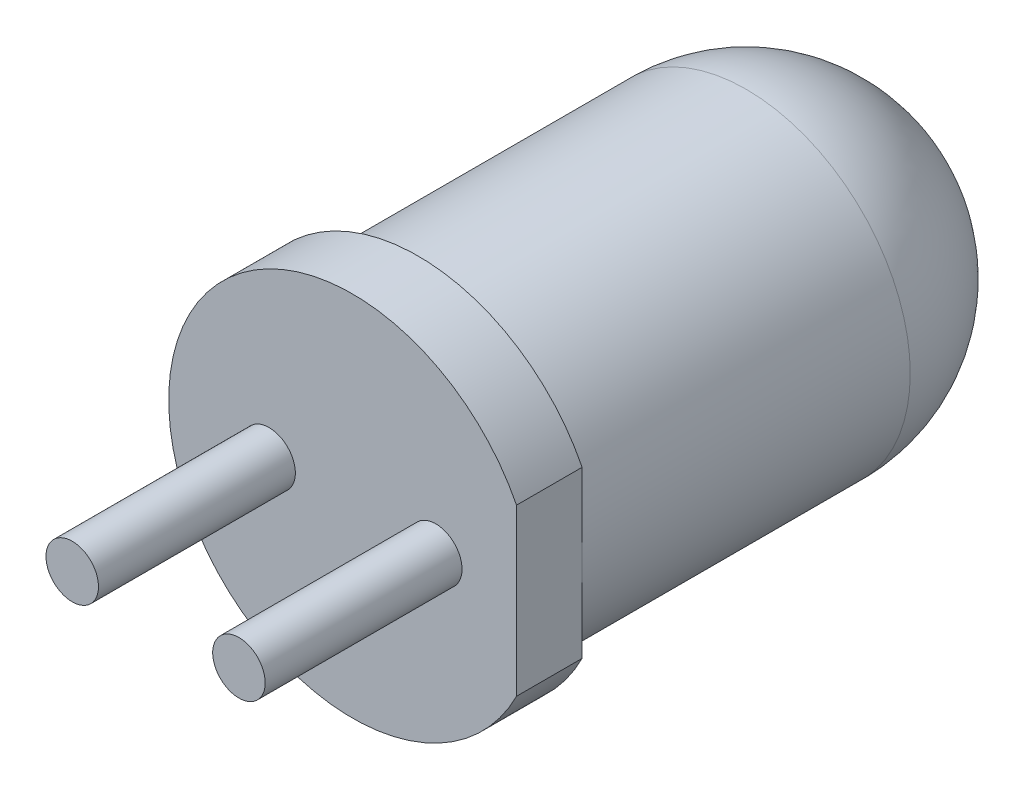
ISO-10303-21;
HEADER;
FILE_DESCRIPTION(('STEP AP214'),'2;1');
FILE_NAME('part.step','',(''),(''),'','','');
FILE_SCHEMA(('AUTOMOTIVE_DESIGN { 1 0 10303 214 1 1 1 1 }'));
ENDSEC;
DATA;
#1=APPLICATION_CONTEXT('core data for automotive mechanical design processes');
#2=APPLICATION_PROTOCOL_DEFINITION('international standard','automotive_design',2000,#1);
#3=PRODUCT_CONTEXT('',#1,'mechanical');
#4=PRODUCT('Part','Part','',(#3));
#5=PRODUCT_RELATED_PRODUCT_CATEGORY('part','',(#4));
#6=PRODUCT_DEFINITION_FORMATION('','',#4);
#7=PRODUCT_DEFINITION_CONTEXT('part definition',#1,'design');
#8=PRODUCT_DEFINITION('design','',#6,#7);
#9=PRODUCT_DEFINITION_SHAPE('','',#8);
#10=(LENGTH_UNIT() NAMED_UNIT(*) SI_UNIT(.MILLI.,.METRE.));
#11=(NAMED_UNIT(*) PLANE_ANGLE_UNIT() SI_UNIT($,.RADIAN.));
#12=(NAMED_UNIT(*) SI_UNIT($,.STERADIAN.) SOLID_ANGLE_UNIT());
#13=UNCERTAINTY_MEASURE_WITH_UNIT(LENGTH_MEASURE(1.E-05),#10,'distance_accuracy_value','');
#14=(GEOMETRIC_REPRESENTATION_CONTEXT(3) GLOBAL_UNCERTAINTY_ASSIGNED_CONTEXT((#13)) GLOBAL_UNIT_ASSIGNED_CONTEXT((#10,
#11,#12)) REPRESENTATION_CONTEXT('',''));
#15=CARTESIAN_POINT('',(0.,0.,0.));
#16=DIRECTION('',(0.,0.,1.));
#17=DIRECTION('',(1.,0.,0.));
#18=AXIS2_PLACEMENT_3D('',#15,#16,#17);
#19=CARTESIAN_POINT('',(0.,0.,8.5));
#20=DIRECTION('',(0.,0.,1.));
#21=DIRECTION('',(1.,0.,0.));
#22=AXIS2_PLACEMENT_3D('',#19,#20,#21);
#23=PLANE('',#22);
#24=CARTESIAN_POINT('',(1.27,0.,8.5));
#25=DIRECTION('',(0.,0.,1.));
#26=DIRECTION('',(1.,0.,0.));
#27=AXIS2_PLACEMENT_3D('',#24,#25,#26);
#28=CIRCLE('',#27,0.4);
#29=CARTESIAN_POINT('',(1.67,0.,8.5));
#30=VERTEX_POINT('',#29);
#31=EDGE_CURVE('E129',#30,#30,#28,.T.);
#32=ORIENTED_EDGE('',*,*,#31,.F.);
#33=EDGE_LOOP('',(#32));
#34=FACE_BOUND('',#33,.T.);
#35=DIRECTION('',(0.,1.,0.));
#36=VECTOR('',#35,1.);
#37=CARTESIAN_POINT('',(2.5,1.26095202129185,8.5));
#38=LINE('',#37,#36);
#39=CARTESIAN_POINT('',(2.5,-1.26095202129185,8.5));
#40=VERTEX_POINT('',#39);
#41=CARTESIAN_POINT('',(2.5,1.26095202129185,8.5));
#42=VERTEX_POINT('',#41);
#43=EDGE_CURVE('E73',#40,#42,#38,.T.);
#44=ORIENTED_EDGE('',*,*,#43,.T.);
#45=CARTESIAN_POINT('',(0.,0.,8.5));
#46=DIRECTION('',(0.,0.,1.));
#47=DIRECTION('',(1.,0.,0.));
#48=AXIS2_PLACEMENT_3D('',#45,#46,#47);
#49=CIRCLE('',#48,2.8);
#50=EDGE_CURVE('E63',#42,#40,#49,.T.);
#51=ORIENTED_EDGE('',*,*,#50,.T.);
#52=EDGE_LOOP('',(#44,#51));
#53=FACE_BOUND('',#52,.T.);
#54=CARTESIAN_POINT('',(-1.27,0.,8.5));
#55=DIRECTION('',(0.,0.,1.));
#56=DIRECTION('',(-1.,0.,0.));
#57=AXIS2_PLACEMENT_3D('',#54,#55,#56);
#58=CIRCLE('',#57,0.4);
#59=CARTESIAN_POINT('',(-1.67,0.,8.5));
#60=VERTEX_POINT('',#59);
#61=EDGE_CURVE('E130',#60,#60,#58,.T.);
#62=ORIENTED_EDGE('',*,*,#61,.F.);
#63=EDGE_LOOP('',(#62));
#64=FACE_BOUND('',#63,.T.);
#65=ADVANCED_FACE('F28',(#34,#53,#64),#23,.T.);
#66=CARTESIAN_POINT('',(0.,0.,8.5));
#67=DIRECTION('',(0.,0.,-1.));
#68=DIRECTION('',(-1.,0.,0.));
#69=AXIS2_PLACEMENT_3D('',#66,#67,#68);
#70=CYLINDRICAL_SURFACE('',#69,2.5);
#71=CARTESIAN_POINT('',(0.,0.,2.5));
#72=DIRECTION('',(0.,0.,-1.));
#73=DIRECTION('',(-1.,0.,0.));
#74=AXIS2_PLACEMENT_3D('',#71,#72,#73);
#75=CIRCLE('',#74,2.5);
#76=CARTESIAN_POINT('',(-2.5,0.,2.5));
#77=VERTEX_POINT('',#76);
#78=EDGE_CURVE('E11',#77,#77,#75,.F.);
#79=ORIENTED_EDGE('',*,*,#78,.T.);
#80=EDGE_LOOP('',(#79));
#81=FACE_BOUND('',#80,.T.);
#82=CARTESIAN_POINT('',(0.,0.,7.5));
#83=DIRECTION('',(0.,0.,1.));
#84=DIRECTION('',(1.,0.,0.));
#85=AXIS2_PLACEMENT_3D('',#82,#83,#84);
#86=CIRCLE('',#85,2.5);
#87=CARTESIAN_POINT('',(2.5,0.,7.5));
#88=VERTEX_POINT('',#87);
#89=EDGE_CURVE('E36',#88,#88,#86,.T.);
#90=ORIENTED_EDGE('',*,*,#89,.F.);
#91=EDGE_LOOP('',(#90));
#92=FACE_BOUND('',#91,.T.);
#93=ADVANCED_FACE('F30',(#81,#92),#70,.T.);
#94=CARTESIAN_POINT('',(0.,0.,7.5));
#95=DIRECTION('',(0.,0.,1.));
#96=DIRECTION('',(1.,0.,0.));
#97=AXIS2_PLACEMENT_3D('',#94,#95,#96);
#98=PLANE('',#97);
#99=DIRECTION('',(0.,1.,0.));
#100=VECTOR('',#99,1.);
#101=CARTESIAN_POINT('',(2.5,1.26095202129185,7.5));
#102=LINE('',#101,#100);
#103=CARTESIAN_POINT('',(2.5,1.26095202129185,7.5));
#104=VERTEX_POINT('',#103);
#105=EDGE_CURVE('E47',#88,#104,#102,.T.);
#106=ORIENTED_EDGE('',*,*,#105,.F.);
#107=ORIENTED_EDGE('',*,*,#89,.T.);
#108=CARTESIAN_POINT('',(2.5,-1.26095202129185,7.5));
#109=VERTEX_POINT('',#108);
#110=EDGE_CURVE('E69',#109,#88,#102,.T.);
#111=ORIENTED_EDGE('',*,*,#110,.F.);
#112=CARTESIAN_POINT('',(0.,0.,7.5));
#113=DIRECTION('',(0.,0.,1.));
#114=DIRECTION('',(1.,0.,0.));
#115=AXIS2_PLACEMENT_3D('',#112,#113,#114);
#116=CIRCLE('',#115,2.8);
#117=EDGE_CURVE('E65',#104,#109,#116,.T.);
#118=ORIENTED_EDGE('',*,*,#117,.F.);
#119=EDGE_LOOP('',(#106,#107,#111,#118));
#120=FACE_BOUND('',#119,.T.);
#121=ADVANCED_FACE('F83',(#120),#98,.F.);
#122=CARTESIAN_POINT('',(2.5,1.26095202129185,7.5));
#123=DIRECTION('',(1.,0.,0.));
#124=DIRECTION('',(0.,0.,-1.));
#125=AXIS2_PLACEMENT_3D('',#122,#123,#124);
#126=PLANE('',#125);
#127=ORIENTED_EDGE('',*,*,#110,.T.);
#128=ORIENTED_EDGE('',*,*,#105,.T.);
#129=DIRECTION('',(0.,0.,1.));
#130=VECTOR('',#129,1.);
#131=CARTESIAN_POINT('',(2.5,1.26095202129185,7.5));
#132=LINE('',#131,#130);
#133=EDGE_CURVE('E68',#104,#42,#132,.T.);
#134=ORIENTED_EDGE('',*,*,#133,.T.);
#135=ORIENTED_EDGE('',*,*,#43,.F.);
#136=DIRECTION('',(0.,0.,1.));
#137=VECTOR('',#136,1.);
#138=CARTESIAN_POINT('',(2.5,-1.26095202129185,7.5));
#139=LINE('',#138,#137);
#140=EDGE_CURVE('E60',#109,#40,#139,.T.);
#141=ORIENTED_EDGE('',*,*,#140,.F.);
#142=EDGE_LOOP('',(#127,#128,#134,#135,#141));
#143=FACE_BOUND('',#142,.T.);
#144=ADVANCED_FACE('F76',(#143),#126,.T.);
#145=CARTESIAN_POINT('',(0.,0.,7.5));
#146=DIRECTION('',(0.,0.,1.));
#147=DIRECTION('',(1.,0.,0.));
#148=AXIS2_PLACEMENT_3D('',#145,#146,#147);
#149=CYLINDRICAL_SURFACE('',#148,2.8);
#150=ORIENTED_EDGE('',*,*,#50,.F.);
#151=ORIENTED_EDGE('',*,*,#133,.F.);
#152=ORIENTED_EDGE('',*,*,#117,.T.);
#153=ORIENTED_EDGE('',*,*,#140,.T.);
#154=EDGE_LOOP('',(#150,#151,#152,#153));
#155=FACE_BOUND('',#154,.T.);
#156=ADVANCED_FACE('F62',(#155),#149,.T.);
#157=CARTESIAN_POINT('',(0.,0.,2.5));
#158=DIRECTION('',(0.,0.,1.));
#159=DIRECTION('',(1.,0.,0.));
#160=AXIS2_PLACEMENT_3D('',#157,#158,#159);
#161=SPHERICAL_SURFACE('',#160,2.5);
#162=ORIENTED_EDGE('',*,*,#78,.F.);
#163=EDGE_LOOP('',(#162));
#164=FACE_BOUND('',#163,.T.);
#165=ADVANCED_FACE('F102',(#164),#161,.T.);
#166=CARTESIAN_POINT('',(1.27,0.,11.5));
#167=DIRECTION('',(0.,0.,-1.));
#168=DIRECTION('',(-1.,0.,0.));
#169=AXIS2_PLACEMENT_3D('',#166,#167,#168);
#170=CYLINDRICAL_SURFACE('',#169,0.4);
#171=CARTESIAN_POINT('',(1.27,0.,11.5));
#172=DIRECTION('',(0.,0.,1.));
#173=DIRECTION('',(1.,0.,0.));
#174=AXIS2_PLACEMENT_3D('',#171,#172,#173);
#175=CIRCLE('',#174,0.4);
#176=CARTESIAN_POINT('',(1.67,0.,11.5));
#177=VERTEX_POINT('',#176);
#178=EDGE_CURVE('E74',#177,#177,#175,.T.);
#179=ORIENTED_EDGE('',*,*,#178,.F.);
#180=EDGE_LOOP('',(#179));
#181=FACE_BOUND('',#180,.T.);
#182=ORIENTED_EDGE('',*,*,#31,.T.);
#183=EDGE_LOOP('',(#182));
#184=FACE_BOUND('',#183,.T.);
#185=ADVANCED_FACE('F105',(#181,#184),#170,.T.);
#186=CARTESIAN_POINT('',(1.27,0.,11.5));
#187=DIRECTION('',(0.,0.,1.));
#188=DIRECTION('',(1.,0.,0.));
#189=AXIS2_PLACEMENT_3D('',#186,#187,#188);
#190=PLANE('',#189);
#191=ORIENTED_EDGE('',*,*,#178,.T.);
#192=EDGE_LOOP('',(#191));
#193=FACE_BOUND('',#192,.T.);
#194=ADVANCED_FACE('F109',(#193),#190,.T.);
#195=CARTESIAN_POINT('',(-1.27,0.,11.5));
#196=DIRECTION('',(0.,0.,-1.));
#197=DIRECTION('',(-1.,0.,0.));
#198=AXIS2_PLACEMENT_3D('',#195,#196,#197);
#199=CYLINDRICAL_SURFACE('',#198,0.4);
#200=CARTESIAN_POINT('',(-1.27,0.,11.5));
#201=DIRECTION('',(0.,0.,1.));
#202=DIRECTION('',(-1.,0.,0.));
#203=AXIS2_PLACEMENT_3D('',#200,#201,#202);
#204=CIRCLE('',#203,0.4);
#205=CARTESIAN_POINT('',(-1.67,0.,11.5));
#206=VERTEX_POINT('',#205);
#207=EDGE_CURVE('E128',#206,#206,#204,.T.);
#208=ORIENTED_EDGE('',*,*,#207,.F.);
#209=EDGE_LOOP('',(#208));
#210=FACE_BOUND('',#209,.T.);
#211=ORIENTED_EDGE('',*,*,#61,.T.);
#212=EDGE_LOOP('',(#211));
#213=FACE_BOUND('',#212,.T.);
#214=ADVANCED_FACE('F116',(#210,#213),#199,.T.);
#215=CARTESIAN_POINT('',(-1.27,0.,11.5));
#216=DIRECTION('',(0.,0.,-1.));
#217=DIRECTION('',(-1.,0.,0.));
#218=AXIS2_PLACEMENT_3D('',#215,#216,#217);
#219=PLANE('',#218);
#220=ORIENTED_EDGE('',*,*,#207,.T.);
#221=EDGE_LOOP('',(#220));
#222=FACE_BOUND('',#221,.T.);
#223=ADVANCED_FACE('F120',(#222),#219,.F.);
#224=CLOSED_SHELL('',(#65,#93,#121,#144,#156,#165,#185,#194,#214,#223));
#225=MANIFOLD_SOLID_BREP('B2',#224);
#226=ADVANCED_BREP_SHAPE_REPRESENTATION('',(#18,#225),#14);
#227=SHAPE_DEFINITION_REPRESENTATION(#9,#226);
ENDSEC;
END-ISO-10303-21;
